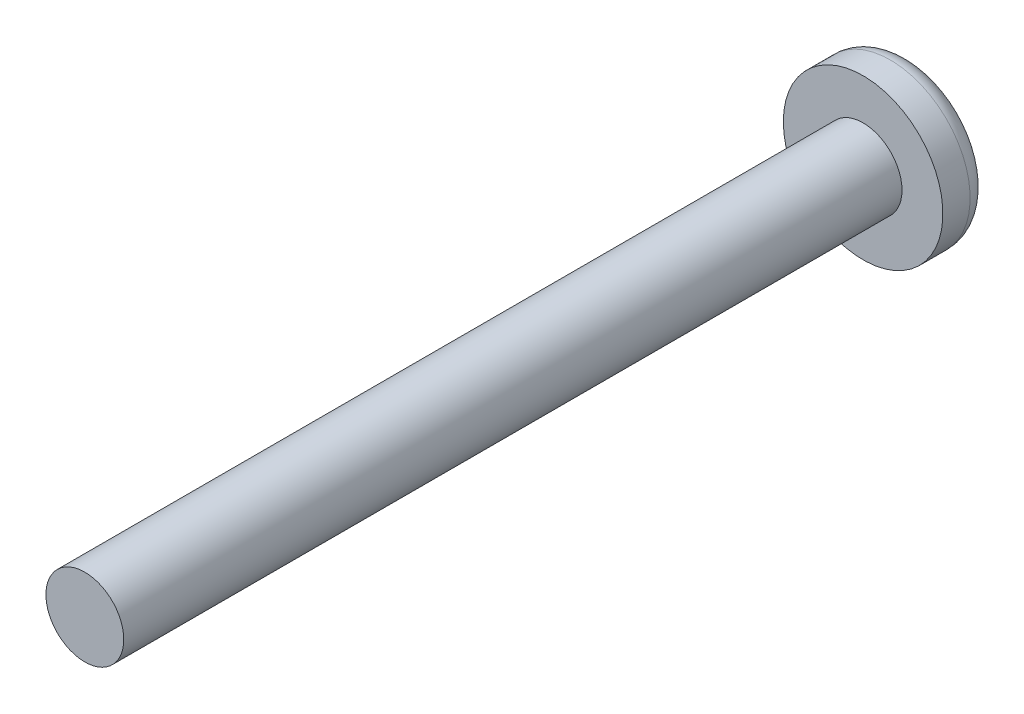
ISO-10303-21;
HEADER;
FILE_DESCRIPTION(('STEP AP214'),'2;1');
FILE_NAME('part.step','',(''),(''),'','','');
FILE_SCHEMA(('AUTOMOTIVE_DESIGN { 1 0 10303 214 1 1 1 1 }'));
ENDSEC;
DATA;
#1=APPLICATION_CONTEXT('core data for automotive mechanical design processes');
#2=APPLICATION_PROTOCOL_DEFINITION('international standard','automotive_design',2000,#1);
#3=PRODUCT_CONTEXT('',#1,'mechanical');
#4=PRODUCT('Part','Part','',(#3));
#5=PRODUCT_RELATED_PRODUCT_CATEGORY('part','',(#4));
#6=PRODUCT_DEFINITION_FORMATION('','',#4);
#7=PRODUCT_DEFINITION_CONTEXT('part definition',#1,'design');
#8=PRODUCT_DEFINITION('design','',#6,#7);
#9=PRODUCT_DEFINITION_SHAPE('','',#8);
#10=(LENGTH_UNIT() NAMED_UNIT(*) SI_UNIT(.MILLI.,.METRE.));
#11=(NAMED_UNIT(*) PLANE_ANGLE_UNIT() SI_UNIT($,.RADIAN.));
#12=(NAMED_UNIT(*) SI_UNIT($,.STERADIAN.) SOLID_ANGLE_UNIT());
#13=UNCERTAINTY_MEASURE_WITH_UNIT(LENGTH_MEASURE(1.E-05),#10,'distance_accuracy_value','');
#14=(GEOMETRIC_REPRESENTATION_CONTEXT(3) GLOBAL_UNCERTAINTY_ASSIGNED_CONTEXT((#13)) GLOBAL_UNIT_ASSIGNED_CONTEXT((#10,
#11,#12)) REPRESENTATION_CONTEXT('',''));
#15=CARTESIAN_POINT('',(0.,0.,0.));
#16=DIRECTION('',(0.,0.,1.));
#17=DIRECTION('',(1.,0.,0.));
#18=AXIS2_PLACEMENT_3D('',#15,#16,#17);
#19=CARTESIAN_POINT('',(0.,0.,20.));
#20=DIRECTION('',(0.,0.,-1.));
#21=DIRECTION('',(-1.,0.,0.));
#22=AXIS2_PLACEMENT_3D('',#19,#20,#21);
#23=CYLINDRICAL_SURFACE('',#22,1.);
#24=CARTESIAN_POINT('',(0.,0.,20.));
#25=DIRECTION('',(0.,0.,1.));
#26=DIRECTION('',(1.,0.,0.));
#27=AXIS2_PLACEMENT_3D('',#24,#25,#26);
#28=CIRCLE('',#27,1.);
#29=CARTESIAN_POINT('',(1.,0.,20.));
#30=VERTEX_POINT('',#29);
#31=EDGE_CURVE('E212',#30,#30,#28,.T.);
#32=ORIENTED_EDGE('',*,*,#31,.F.);
#33=EDGE_LOOP('',(#32));
#34=FACE_BOUND('',#33,.T.);
#35=CARTESIAN_POINT('',(0.,0.,0.));
#36=DIRECTION('',(0.,0.,1.));
#37=DIRECTION('',(1.,0.,0.));
#38=AXIS2_PLACEMENT_3D('',#35,#36,#37);
#39=CIRCLE('',#38,1.);
#40=CARTESIAN_POINT('',(1.,0.,0.));
#41=VERTEX_POINT('',#40);
#42=EDGE_CURVE('E211',#41,#41,#39,.T.);
#43=ORIENTED_EDGE('',*,*,#42,.T.);
#44=EDGE_LOOP('',(#43));
#45=FACE_BOUND('',#44,.T.);
#46=ADVANCED_FACE('F35',(#34,#45),#23,.T.);
#47=CARTESIAN_POINT('',(0.,0.,20.));
#48=DIRECTION('',(0.,0.,1.));
#49=DIRECTION('',(1.,0.,0.));
#50=AXIS2_PLACEMENT_3D('',#47,#48,#49);
#51=PLANE('',#50);
#52=ORIENTED_EDGE('',*,*,#31,.T.);
#53=EDGE_LOOP('',(#52));
#54=FACE_BOUND('',#53,.T.);
#55=ADVANCED_FACE('F235',(#54),#51,.T.);
#56=CARTESIAN_POINT('',(0.,0.,-1.2));
#57=DIRECTION('',(0.,0.,1.));
#58=DIRECTION('',(1.,0.,0.));
#59=AXIS2_PLACEMENT_3D('',#56,#57,#58);
#60=CYLINDRICAL_SURFACE('',#59,2.05);
#61=CARTESIAN_POINT('',(0.,0.,-0.7));
#62=DIRECTION('',(0.,0.,-1.));
#63=DIRECTION('',(-1.,0.,0.));
#64=AXIS2_PLACEMENT_3D('',#61,#62,#63);
#65=CIRCLE('',#64,2.05);
#66=CARTESIAN_POINT('',(-2.05,0.,-0.7));
#67=VERTEX_POINT('',#66);
#68=EDGE_CURVE('E11',#67,#67,#65,.F.);
#69=ORIENTED_EDGE('',*,*,#68,.T.);
#70=EDGE_LOOP('',(#69));
#71=FACE_BOUND('',#70,.T.);
#72=CARTESIAN_POINT('',(0.,0.,0.));
#73=DIRECTION('',(0.,0.,-1.));
#74=DIRECTION('',(-1.,0.,0.));
#75=AXIS2_PLACEMENT_3D('',#72,#73,#74);
#76=CIRCLE('',#75,2.05);
#77=CARTESIAN_POINT('',(-2.05,0.,0.));
#78=VERTEX_POINT('',#77);
#79=EDGE_CURVE('E191',#78,#78,#76,.T.);
#80=ORIENTED_EDGE('',*,*,#79,.T.);
#81=EDGE_LOOP('',(#80));
#82=FACE_BOUND('',#81,.T.);
#83=ADVANCED_FACE('F240',(#71,#82),#60,.T.);
#84=CARTESIAN_POINT('',(0.,0.,-1.2));
#85=DIRECTION('',(0.,0.,-1.));
#86=DIRECTION('',(-1.,0.,0.));
#87=AXIS2_PLACEMENT_3D('',#84,#85,#86);
#88=PLANE('',#87);
#89=DIRECTION('',(1.,0.,0.));
#90=VECTOR('',#89,1.);
#91=CARTESIAN_POINT('',(0.25,1.,-1.2));
#92=LINE('',#91,#90);
#93=CARTESIAN_POINT('',(-0.25,1.,-1.2));
#94=VERTEX_POINT('',#93);
#95=CARTESIAN_POINT('',(0.25,1.,-1.2));
#96=VERTEX_POINT('',#95);
#97=EDGE_CURVE('E50',#94,#96,#92,.T.);
#98=ORIENTED_EDGE('',*,*,#97,.F.);
#99=DIRECTION('',(0.,1.,0.));
#100=VECTOR('',#99,1.);
#101=CARTESIAN_POINT('',(-0.25,0.25,-1.2));
#102=LINE('',#101,#100);
#103=CARTESIAN_POINT('',(-0.25,0.25,-1.2));
#104=VERTEX_POINT('',#103);
#105=EDGE_CURVE('E187',#104,#94,#102,.T.);
#106=ORIENTED_EDGE('',*,*,#105,.F.);
#107=DIRECTION('',(1.,0.,0.));
#108=VECTOR('',#107,1.);
#109=CARTESIAN_POINT('',(-0.25,0.25,-1.2));
#110=LINE('',#109,#108);
#111=CARTESIAN_POINT('',(-1.,0.25,-1.2));
#112=VERTEX_POINT('',#111);
#113=EDGE_CURVE('E185',#112,#104,#110,.T.);
#114=ORIENTED_EDGE('',*,*,#113,.F.);
#115=DIRECTION('',(0.,1.,0.));
#116=VECTOR('',#115,1.);
#117=CARTESIAN_POINT('',(-1.,0.25,-1.2));
#118=LINE('',#117,#116);
#119=CARTESIAN_POINT('',(-1.,-0.25,-1.2));
#120=VERTEX_POINT('',#119);
#121=EDGE_CURVE('E134',#120,#112,#118,.T.);
#122=ORIENTED_EDGE('',*,*,#121,.F.);
#123=DIRECTION('',(-1.,0.,0.));
#124=VECTOR('',#123,1.);
#125=CARTESIAN_POINT('',(-0.25,-0.25,-1.2));
#126=LINE('',#125,#124);
#127=CARTESIAN_POINT('',(-0.25,-0.25,-1.2));
#128=VERTEX_POINT('',#127);
#129=EDGE_CURVE('E181',#128,#120,#126,.T.);
#130=ORIENTED_EDGE('',*,*,#129,.F.);
#131=DIRECTION('',(0.,1.,0.));
#132=VECTOR('',#131,1.);
#133=CARTESIAN_POINT('',(-0.25,-0.25,-1.2));
#134=LINE('',#133,#132);
#135=CARTESIAN_POINT('',(-0.25,-1.,-1.2));
#136=VERTEX_POINT('',#135);
#137=EDGE_CURVE('E178',#136,#128,#134,.T.);
#138=ORIENTED_EDGE('',*,*,#137,.F.);
#139=DIRECTION('',(-1.,0.,0.));
#140=VECTOR('',#139,1.);
#141=CARTESIAN_POINT('',(0.25,-1.,-1.2));
#142=LINE('',#141,#140);
#143=CARTESIAN_POINT('',(0.25,-1.,-1.2));
#144=VERTEX_POINT('',#143);
#145=EDGE_CURVE('E175',#144,#136,#142,.T.);
#146=ORIENTED_EDGE('',*,*,#145,.F.);
#147=DIRECTION('',(0.,-1.,0.));
#148=VECTOR('',#147,1.);
#149=CARTESIAN_POINT('',(0.25,-0.25,-1.2));
#150=LINE('',#149,#148);
#151=CARTESIAN_POINT('',(0.25,-0.25,-1.2));
#152=VERTEX_POINT('',#151);
#153=EDGE_CURVE('E172',#152,#144,#150,.T.);
#154=ORIENTED_EDGE('',*,*,#153,.F.);
#155=DIRECTION('',(-1.,0.,0.));
#156=VECTOR('',#155,1.);
#157=CARTESIAN_POINT('',(0.25,-0.25,-1.2));
#158=LINE('',#157,#156);
#159=CARTESIAN_POINT('',(1.,-0.25,-1.2));
#160=VERTEX_POINT('',#159);
#161=EDGE_CURVE('E169',#160,#152,#158,.T.);
#162=ORIENTED_EDGE('',*,*,#161,.F.);
#163=DIRECTION('',(0.,-1.,0.));
#164=VECTOR('',#163,1.);
#165=CARTESIAN_POINT('',(1.,0.25,-1.2));
#166=LINE('',#165,#164);
#167=CARTESIAN_POINT('',(1.,0.25,-1.2));
#168=VERTEX_POINT('',#167);
#169=EDGE_CURVE('E166',#168,#160,#166,.T.);
#170=ORIENTED_EDGE('',*,*,#169,.F.);
#171=DIRECTION('',(1.,0.,0.));
#172=VECTOR('',#171,1.);
#173=CARTESIAN_POINT('',(0.25,0.25,-1.2));
#174=LINE('',#173,#172);
#175=CARTESIAN_POINT('',(0.25,0.25,-1.2));
#176=VERTEX_POINT('',#175);
#177=EDGE_CURVE('E163',#176,#168,#174,.T.);
#178=ORIENTED_EDGE('',*,*,#177,.F.);
#179=DIRECTION('',(0.,-1.,0.));
#180=VECTOR('',#179,1.);
#181=CARTESIAN_POINT('',(0.25,0.25,-1.2));
#182=LINE('',#181,#180);
#183=EDGE_CURVE('E160',#96,#176,#182,.T.);
#184=ORIENTED_EDGE('',*,*,#183,.F.);
#185=EDGE_LOOP('',(#98,#106,#114,#122,#130,#138,#146,#154,#162,#170,#178,#184));
#186=FACE_BOUND('',#185,.T.);
#187=CARTESIAN_POINT('',(0.,0.,-1.2));
#188=DIRECTION('',(0.,0.,-1.));
#189=DIRECTION('',(-1.,0.,0.));
#190=AXIS2_PLACEMENT_3D('',#187,#188,#189);
#191=CIRCLE('',#190,1.55);
#192=CARTESIAN_POINT('',(-1.55,0.,-1.2));
#193=VERTEX_POINT('',#192);
#194=EDGE_CURVE('E43',#193,#193,#191,.T.);
#195=ORIENTED_EDGE('',*,*,#194,.T.);
#196=EDGE_LOOP('',(#195));
#197=FACE_BOUND('',#196,.T.);
#198=ADVANCED_FACE('F219',(#186,#197),#88,.T.);
#199=CARTESIAN_POINT('',(0.,0.,0.));
#200=DIRECTION('',(0.,0.,-1.));
#201=DIRECTION('',(-1.,0.,0.));
#202=AXIS2_PLACEMENT_3D('',#199,#200,#201);
#203=PLANE('',#202);
#204=ORIENTED_EDGE('',*,*,#42,.F.);
#205=EDGE_LOOP('',(#204));
#206=FACE_BOUND('',#205,.T.);
#207=ORIENTED_EDGE('',*,*,#79,.F.);
#208=EDGE_LOOP('',(#207));
#209=FACE_BOUND('',#208,.T.);
#210=ADVANCED_FACE('F223',(#206,#209),#203,.F.);
#211=CARTESIAN_POINT('',(0.,0.,-0.7));
#212=DIRECTION('',(0.,0.,-1.));
#213=DIRECTION('',(-1.,0.,0.));
#214=AXIS2_PLACEMENT_3D('',#211,#212,#213);
#215=TOROIDAL_SURFACE('',#214,1.55,0.5);
#216=ORIENTED_EDGE('',*,*,#68,.F.);
#217=EDGE_LOOP('',(#216));
#218=FACE_BOUND('',#217,.T.);
#219=ORIENTED_EDGE('',*,*,#194,.F.);
#220=EDGE_LOOP('',(#219));
#221=FACE_BOUND('',#220,.T.);
#222=ADVANCED_FACE('F37',(#218,#221),#215,.T.);
#223=CARTESIAN_POINT('',(0.25,1.,-0.7));
#224=DIRECTION('',(0.,1.,0.));
#225=DIRECTION('',(0.,0.,1.));
#226=AXIS2_PLACEMENT_3D('',#223,#224,#225);
#227=PLANE('',#226);
#228=ORIENTED_EDGE('',*,*,#97,.T.);
#229=DIRECTION('',(0.,0.,-1.));
#230=VECTOR('',#229,1.);
#231=CARTESIAN_POINT('',(0.25,1.,-0.7));
#232=LINE('',#231,#230);
#233=CARTESIAN_POINT('',(0.25,1.,-0.7));
#234=VERTEX_POINT('',#233);
#235=EDGE_CURVE('E98',#234,#96,#232,.T.);
#236=ORIENTED_EDGE('',*,*,#235,.F.);
#237=DIRECTION('',(1.,0.,0.));
#238=VECTOR('',#237,1.);
#239=CARTESIAN_POINT('',(0.25,1.,-0.7));
#240=LINE('',#239,#238);
#241=CARTESIAN_POINT('',(-0.25,1.,-0.7));
#242=VERTEX_POINT('',#241);
#243=EDGE_CURVE('E189',#242,#234,#240,.T.);
#244=ORIENTED_EDGE('',*,*,#243,.F.);
#245=DIRECTION('',(0.,0.,-1.));
#246=VECTOR('',#245,1.);
#247=CARTESIAN_POINT('',(-0.25,1.,-0.7));
#248=LINE('',#247,#246);
#249=EDGE_CURVE('E58',#242,#94,#248,.T.);
#250=ORIENTED_EDGE('',*,*,#249,.T.);
#251=EDGE_LOOP('',(#228,#236,#244,#250));
#252=FACE_BOUND('',#251,.T.);
#253=ADVANCED_FACE('F222',(#252),#227,.F.);
#254=CARTESIAN_POINT('',(-0.25,0.25,-0.7));
#255=DIRECTION('',(-1.,0.,0.));
#256=DIRECTION('',(0.,-1.,0.));
#257=AXIS2_PLACEMENT_3D('',#254,#255,#256);
#258=PLANE('',#257);
#259=ORIENTED_EDGE('',*,*,#105,.T.);
#260=ORIENTED_EDGE('',*,*,#249,.F.);
#261=DIRECTION('',(0.,1.,0.));
#262=VECTOR('',#261,1.);
#263=CARTESIAN_POINT('',(-0.25,0.25,-0.7));
#264=LINE('',#263,#262);
#265=CARTESIAN_POINT('',(-0.25,0.25,-0.7));
#266=VERTEX_POINT('',#265);
#267=EDGE_CURVE('E146',#266,#242,#264,.T.);
#268=ORIENTED_EDGE('',*,*,#267,.F.);
#269=DIRECTION('',(0.,0.,-1.));
#270=VECTOR('',#269,1.);
#271=CARTESIAN_POINT('',(-0.25,0.25,-0.7));
#272=LINE('',#271,#270);
#273=EDGE_CURVE('E138',#266,#104,#272,.T.);
#274=ORIENTED_EDGE('',*,*,#273,.T.);
#275=EDGE_LOOP('',(#259,#260,#268,#274));
#276=FACE_BOUND('',#275,.T.);
#277=ADVANCED_FACE('F229',(#276),#258,.F.);
#278=CARTESIAN_POINT('',(-0.25,0.25,-0.7));
#279=DIRECTION('',(0.,1.,0.));
#280=DIRECTION('',(-1.,0.,0.));
#281=AXIS2_PLACEMENT_3D('',#278,#279,#280);
#282=PLANE('',#281);
#283=ORIENTED_EDGE('',*,*,#113,.T.);
#284=ORIENTED_EDGE('',*,*,#273,.F.);
#285=DIRECTION('',(1.,0.,0.));
#286=VECTOR('',#285,1.);
#287=CARTESIAN_POINT('',(-0.25,0.25,-0.7));
#288=LINE('',#287,#286);
#289=CARTESIAN_POINT('',(-1.,0.25,-0.7));
#290=VERTEX_POINT('',#289);
#291=EDGE_CURVE('E142',#290,#266,#288,.T.);
#292=ORIENTED_EDGE('',*,*,#291,.F.);
#293=DIRECTION('',(0.,0.,-1.));
#294=VECTOR('',#293,1.);
#295=CARTESIAN_POINT('',(-1.,0.25,-0.7));
#296=LINE('',#295,#294);
#297=EDGE_CURVE('E127',#290,#112,#296,.T.);
#298=ORIENTED_EDGE('',*,*,#297,.T.);
#299=EDGE_LOOP('',(#283,#284,#292,#298));
#300=FACE_BOUND('',#299,.T.);
#301=ADVANCED_FACE('F143',(#300),#282,.F.);
#302=CARTESIAN_POINT('',(-1.,0.25,-0.7));
#303=DIRECTION('',(-1.,0.,0.));
#304=DIRECTION('',(0.,0.,1.));
#305=AXIS2_PLACEMENT_3D('',#302,#303,#304);
#306=PLANE('',#305);
#307=ORIENTED_EDGE('',*,*,#121,.T.);
#308=ORIENTED_EDGE('',*,*,#297,.F.);
#309=DIRECTION('',(0.,1.,0.));
#310=VECTOR('',#309,1.);
#311=CARTESIAN_POINT('',(-1.,0.25,-0.7));
#312=LINE('',#311,#310);
#313=CARTESIAN_POINT('',(-1.,-0.25,-0.7));
#314=VERTEX_POINT('',#313);
#315=EDGE_CURVE('E131',#314,#290,#312,.T.);
#316=ORIENTED_EDGE('',*,*,#315,.F.);
#317=DIRECTION('',(0.,0.,-1.));
#318=VECTOR('',#317,1.);
#319=CARTESIAN_POINT('',(-1.,-0.25,-0.7));
#320=LINE('',#319,#318);
#321=EDGE_CURVE('E139',#314,#120,#320,.T.);
#322=ORIENTED_EDGE('',*,*,#321,.T.);
#323=EDGE_LOOP('',(#307,#308,#316,#322));
#324=FACE_BOUND('',#323,.T.);
#325=ADVANCED_FACE('F129',(#324),#306,.F.);
#326=CARTESIAN_POINT('',(-0.25,-0.25,-0.7));
#327=DIRECTION('',(0.,-1.,0.));
#328=DIRECTION('',(1.,0.,0.));
#329=AXIS2_PLACEMENT_3D('',#326,#327,#328);
#330=PLANE('',#329);
#331=ORIENTED_EDGE('',*,*,#129,.T.);
#332=ORIENTED_EDGE('',*,*,#321,.F.);
#333=DIRECTION('',(-1.,0.,0.));
#334=VECTOR('',#333,1.);
#335=CARTESIAN_POINT('',(-0.25,-0.25,-0.7));
#336=LINE('',#335,#334);
#337=CARTESIAN_POINT('',(-0.25,-0.25,-0.7));
#338=VERTEX_POINT('',#337);
#339=EDGE_CURVE('E152',#338,#314,#336,.T.);
#340=ORIENTED_EDGE('',*,*,#339,.F.);
#341=DIRECTION('',(0.,0.,-1.));
#342=VECTOR('',#341,1.);
#343=CARTESIAN_POINT('',(-0.25,-0.25,-0.7));
#344=LINE('',#343,#342);
#345=EDGE_CURVE('E194',#338,#128,#344,.T.);
#346=ORIENTED_EDGE('',*,*,#345,.T.);
#347=EDGE_LOOP('',(#331,#332,#340,#346));
#348=FACE_BOUND('',#347,.T.);
#349=ADVANCED_FACE('F279',(#348),#330,.F.);
#350=CARTESIAN_POINT('',(-0.25,-0.25,-0.7));
#351=DIRECTION('',(-1.,0.,0.));
#352=DIRECTION('',(0.,-1.,0.));
#353=AXIS2_PLACEMENT_3D('',#350,#351,#352);
#354=PLANE('',#353);
#355=ORIENTED_EDGE('',*,*,#137,.T.);
#356=ORIENTED_EDGE('',*,*,#345,.F.);
#357=DIRECTION('',(0.,1.,0.));
#358=VECTOR('',#357,1.);
#359=CARTESIAN_POINT('',(-0.25,-0.25,-0.7));
#360=LINE('',#359,#358);
#361=CARTESIAN_POINT('',(-0.25,-1.,-0.7));
#362=VERTEX_POINT('',#361);
#363=EDGE_CURVE('E154',#362,#338,#360,.T.);
#364=ORIENTED_EDGE('',*,*,#363,.F.);
#365=DIRECTION('',(0.,0.,-1.));
#366=VECTOR('',#365,1.);
#367=CARTESIAN_POINT('',(-0.25,-1.,-0.7));
#368=LINE('',#367,#366);
#369=EDGE_CURVE('E196',#362,#136,#368,.T.);
#370=ORIENTED_EDGE('',*,*,#369,.T.);
#371=EDGE_LOOP('',(#355,#356,#364,#370));
#372=FACE_BOUND('',#371,.T.);
#373=ADVANCED_FACE('F275',(#372),#354,.F.);
#374=CARTESIAN_POINT('',(0.25,-1.,-0.7));
#375=DIRECTION('',(0.,-1.,0.));
#376=DIRECTION('',(0.,0.,-1.));
#377=AXIS2_PLACEMENT_3D('',#374,#375,#376);
#378=PLANE('',#377);
#379=ORIENTED_EDGE('',*,*,#145,.T.);
#380=ORIENTED_EDGE('',*,*,#369,.F.);
#381=DIRECTION('',(-1.,0.,0.));
#382=VECTOR('',#381,1.);
#383=CARTESIAN_POINT('',(0.25,-1.,-0.7));
#384=LINE('',#383,#382);
#385=CARTESIAN_POINT('',(0.25,-1.,-0.7));
#386=VERTEX_POINT('',#385);
#387=EDGE_CURVE('E423',#386,#362,#384,.T.);
#388=ORIENTED_EDGE('',*,*,#387,.F.);
#389=DIRECTION('',(0.,0.,-1.));
#390=VECTOR('',#389,1.);
#391=CARTESIAN_POINT('',(0.25,-1.,-0.7));
#392=LINE('',#391,#390);
#393=EDGE_CURVE('E198',#386,#144,#392,.T.);
#394=ORIENTED_EDGE('',*,*,#393,.T.);
#395=EDGE_LOOP('',(#379,#380,#388,#394));
#396=FACE_BOUND('',#395,.T.);
#397=ADVANCED_FACE('F271',(#396),#378,.F.);
#398=CARTESIAN_POINT('',(0.25,-0.25,-0.7));
#399=DIRECTION('',(1.,0.,0.));
#400=DIRECTION('',(0.,1.,0.));
#401=AXIS2_PLACEMENT_3D('',#398,#399,#400);
#402=PLANE('',#401);
#403=ORIENTED_EDGE('',*,*,#153,.T.);
#404=ORIENTED_EDGE('',*,*,#393,.F.);
#405=DIRECTION('',(0.,-1.,0.));
#406=VECTOR('',#405,1.);
#407=CARTESIAN_POINT('',(0.25,-0.25,-0.7));
#408=LINE('',#407,#406);
#409=CARTESIAN_POINT('',(0.25,-0.25,-0.7));
#410=VERTEX_POINT('',#409);
#411=EDGE_CURVE('E420',#410,#386,#408,.T.);
#412=ORIENTED_EDGE('',*,*,#411,.F.);
#413=DIRECTION('',(0.,0.,-1.));
#414=VECTOR('',#413,1.);
#415=CARTESIAN_POINT('',(0.25,-0.25,-0.7));
#416=LINE('',#415,#414);
#417=EDGE_CURVE('E200',#410,#152,#416,.T.);
#418=ORIENTED_EDGE('',*,*,#417,.T.);
#419=EDGE_LOOP('',(#403,#404,#412,#418));
#420=FACE_BOUND('',#419,.T.);
#421=ADVANCED_FACE('F267',(#420),#402,.F.);
#422=CARTESIAN_POINT('',(0.25,-0.25,-0.7));
#423=DIRECTION('',(0.,-1.,0.));
#424=DIRECTION('',(1.,0.,0.));
#425=AXIS2_PLACEMENT_3D('',#422,#423,#424);
#426=PLANE('',#425);
#427=ORIENTED_EDGE('',*,*,#161,.T.);
#428=ORIENTED_EDGE('',*,*,#417,.F.);
#429=DIRECTION('',(-1.,0.,0.));
#430=VECTOR('',#429,1.);
#431=CARTESIAN_POINT('',(0.25,-0.25,-0.7));
#432=LINE('',#431,#430);
#433=CARTESIAN_POINT('',(1.,-0.25,-0.7));
#434=VERTEX_POINT('',#433);
#435=EDGE_CURVE('E417',#434,#410,#432,.T.);
#436=ORIENTED_EDGE('',*,*,#435,.F.);
#437=DIRECTION('',(0.,0.,-1.));
#438=VECTOR('',#437,1.);
#439=CARTESIAN_POINT('',(1.,-0.25,-0.7));
#440=LINE('',#439,#438);
#441=EDGE_CURVE('E202',#434,#160,#440,.T.);
#442=ORIENTED_EDGE('',*,*,#441,.T.);
#443=EDGE_LOOP('',(#427,#428,#436,#442));
#444=FACE_BOUND('',#443,.T.);
#445=ADVANCED_FACE('F263',(#444),#426,.F.);
#446=CARTESIAN_POINT('',(1.,0.25,-0.7));
#447=DIRECTION('',(1.,0.,0.));
#448=DIRECTION('',(0.,0.,-1.));
#449=AXIS2_PLACEMENT_3D('',#446,#447,#448);
#450=PLANE('',#449);
#451=ORIENTED_EDGE('',*,*,#169,.T.);
#452=ORIENTED_EDGE('',*,*,#441,.F.);
#453=DIRECTION('',(0.,-1.,0.));
#454=VECTOR('',#453,1.);
#455=CARTESIAN_POINT('',(1.,0.25,-0.7));
#456=LINE('',#455,#454);
#457=CARTESIAN_POINT('',(1.,0.25,-0.7));
#458=VERTEX_POINT('',#457);
#459=EDGE_CURVE('E414',#458,#434,#456,.T.);
#460=ORIENTED_EDGE('',*,*,#459,.F.);
#461=DIRECTION('',(0.,0.,-1.));
#462=VECTOR('',#461,1.);
#463=CARTESIAN_POINT('',(1.,0.25,-0.7));
#464=LINE('',#463,#462);
#465=EDGE_CURVE('E204',#458,#168,#464,.T.);
#466=ORIENTED_EDGE('',*,*,#465,.T.);
#467=EDGE_LOOP('',(#451,#452,#460,#466));
#468=FACE_BOUND('',#467,.T.);
#469=ADVANCED_FACE('F259',(#468),#450,.F.);
#470=CARTESIAN_POINT('',(0.25,0.25,-0.7));
#471=DIRECTION('',(0.,1.,0.));
#472=DIRECTION('',(-1.,0.,0.));
#473=AXIS2_PLACEMENT_3D('',#470,#471,#472);
#474=PLANE('',#473);
#475=ORIENTED_EDGE('',*,*,#177,.T.);
#476=ORIENTED_EDGE('',*,*,#465,.F.);
#477=DIRECTION('',(1.,0.,0.));
#478=VECTOR('',#477,1.);
#479=CARTESIAN_POINT('',(0.25,0.25,-0.7));
#480=LINE('',#479,#478);
#481=CARTESIAN_POINT('',(0.25,0.25,-0.7));
#482=VERTEX_POINT('',#481);
#483=EDGE_CURVE('E409',#482,#458,#480,.T.);
#484=ORIENTED_EDGE('',*,*,#483,.F.);
#485=DIRECTION('',(0.,0.,-1.));
#486=VECTOR('',#485,1.);
#487=CARTESIAN_POINT('',(0.25,0.25,-0.7));
#488=LINE('',#487,#486);
#489=EDGE_CURVE('E206',#482,#176,#488,.T.);
#490=ORIENTED_EDGE('',*,*,#489,.T.);
#491=EDGE_LOOP('',(#475,#476,#484,#490));
#492=FACE_BOUND('',#491,.T.);
#493=ADVANCED_FACE('F255',(#492),#474,.F.);
#494=CARTESIAN_POINT('',(0.25,0.25,-0.7));
#495=DIRECTION('',(1.,0.,0.));
#496=DIRECTION('',(0.,1.,0.));
#497=AXIS2_PLACEMENT_3D('',#494,#495,#496);
#498=PLANE('',#497);
#499=ORIENTED_EDGE('',*,*,#183,.T.);
#500=ORIENTED_EDGE('',*,*,#489,.F.);
#501=DIRECTION('',(0.,-1.,0.));
#502=VECTOR('',#501,1.);
#503=CARTESIAN_POINT('',(0.25,0.25,-0.7));
#504=LINE('',#503,#502);
#505=EDGE_CURVE('E407',#234,#482,#504,.T.);
#506=ORIENTED_EDGE('',*,*,#505,.F.);
#507=ORIENTED_EDGE('',*,*,#235,.T.);
#508=EDGE_LOOP('',(#499,#500,#506,#507));
#509=FACE_BOUND('',#508,.T.);
#510=ADVANCED_FACE('F252',(#509),#498,.F.);
#511=CARTESIAN_POINT('',(0.,0.,-0.7));
#512=DIRECTION('',(0.,0.,-1.));
#513=DIRECTION('',(-1.,0.,0.));
#514=AXIS2_PLACEMENT_3D('',#511,#512,#513);
#515=PLANE('',#514);
#516=ORIENTED_EDGE('',*,*,#243,.T.);
#517=ORIENTED_EDGE('',*,*,#505,.T.);
#518=ORIENTED_EDGE('',*,*,#483,.T.);
#519=ORIENTED_EDGE('',*,*,#459,.T.);
#520=ORIENTED_EDGE('',*,*,#435,.T.);
#521=ORIENTED_EDGE('',*,*,#411,.T.);
#522=ORIENTED_EDGE('',*,*,#387,.T.);
#523=ORIENTED_EDGE('',*,*,#363,.T.);
#524=ORIENTED_EDGE('',*,*,#339,.T.);
#525=ORIENTED_EDGE('',*,*,#315,.T.);
#526=ORIENTED_EDGE('',*,*,#291,.T.);
#527=ORIENTED_EDGE('',*,*,#267,.T.);
#528=EDGE_LOOP('',(#516,#517,#518,#519,#520,#521,#522,#523,#524,#525,#526,#527));
#529=FACE_BOUND('',#528,.T.);
#530=ADVANCED_FACE('F149',(#529),#515,.T.);
#531=CLOSED_SHELL('',(#46,#55,#83,#198,#210,#222,#253,#277,#301,#325,#349,#373,#397,#421,#445,
#469,#493,#510,#530));
#532=MANIFOLD_SOLID_BREP('B2',#531);
#533=ADVANCED_BREP_SHAPE_REPRESENTATION('',(#18,#532),#14);
#534=SHAPE_DEFINITION_REPRESENTATION(#9,#533);
ENDSEC;
END-ISO-10303-21;
